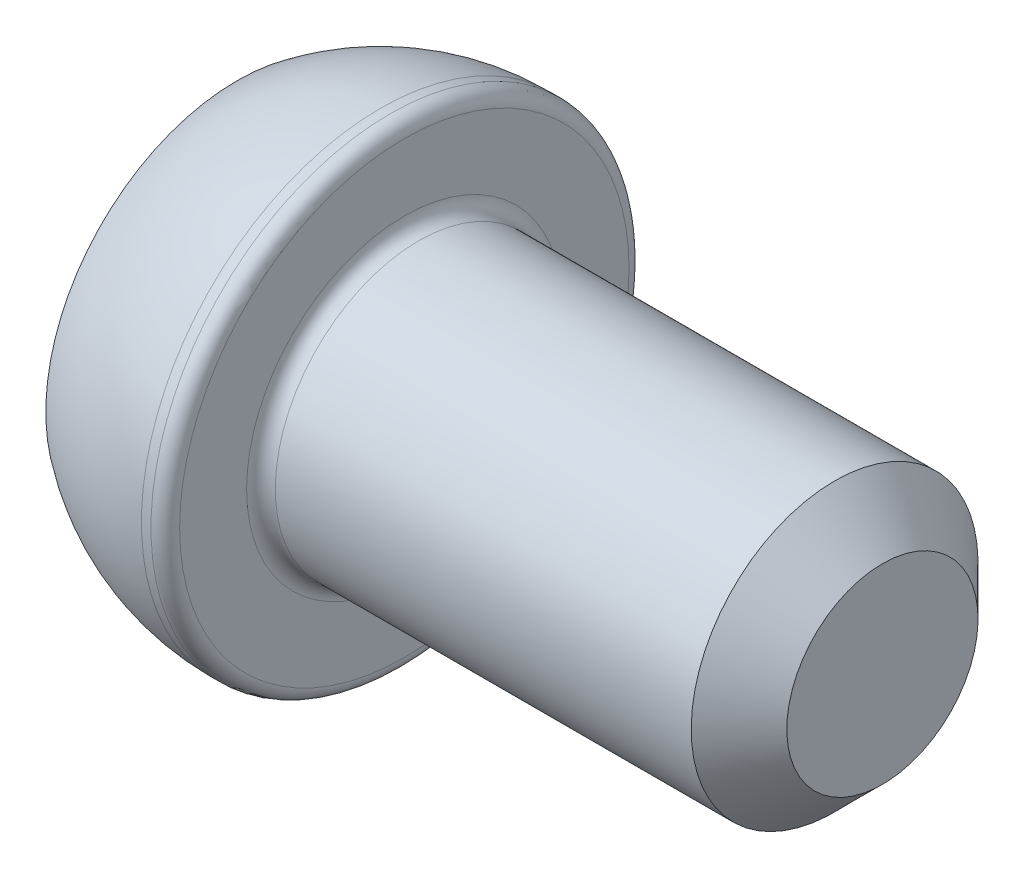
ISO-10303-21;
HEADER;
FILE_DESCRIPTION(('STEP AP214'),'2;1');
FILE_NAME('part.step','',(''),(''),'','','');
FILE_SCHEMA(('AUTOMOTIVE_DESIGN { 1 0 10303 214 1 1 1 1 }'));
ENDSEC;
DATA;
#1=APPLICATION_CONTEXT('core data for automotive mechanical design processes');
#2=APPLICATION_PROTOCOL_DEFINITION('international standard','automotive_design',2000,#1);
#3=PRODUCT_CONTEXT('',#1,'mechanical');
#4=PRODUCT('Part','Part','',(#3));
#5=PRODUCT_RELATED_PRODUCT_CATEGORY('part','',(#4));
#6=PRODUCT_DEFINITION_FORMATION('','',#4);
#7=PRODUCT_DEFINITION_CONTEXT('part definition',#1,'design');
#8=PRODUCT_DEFINITION('design','',#6,#7);
#9=PRODUCT_DEFINITION_SHAPE('','',#8);
#10=(LENGTH_UNIT() NAMED_UNIT(*) SI_UNIT(.MILLI.,.METRE.));
#11=(NAMED_UNIT(*) PLANE_ANGLE_UNIT() SI_UNIT($,.RADIAN.));
#12=(NAMED_UNIT(*) SI_UNIT($,.STERADIAN.) SOLID_ANGLE_UNIT());
#13=UNCERTAINTY_MEASURE_WITH_UNIT(LENGTH_MEASURE(1.E-05),#10,'distance_accuracy_value','');
#14=(GEOMETRIC_REPRESENTATION_CONTEXT(3) GLOBAL_UNCERTAINTY_ASSIGNED_CONTEXT((#13)) GLOBAL_UNIT_ASSIGNED_CONTEXT((#10,
#11,#12)) REPRESENTATION_CONTEXT('',''));
#15=CARTESIAN_POINT('',(0.,0.,0.));
#16=DIRECTION('',(0.,0.,1.));
#17=DIRECTION('',(1.,0.,0.));
#18=AXIS2_PLACEMENT_3D('',#15,#16,#17);
#19=CARTESIAN_POINT('',(0.,0.,0.));
#20=DIRECTION('',(-1.,0.,0.));
#21=DIRECTION('',(0.,-1.,0.));
#22=AXIS2_PLACEMENT_3D('',#19,#20,#21);
#23=PLANE('',#22);
#24=DIRECTION('',(0.,0.866025403784438,-0.5));
#25=VECTOR('',#24,1.);
#26=CARTESIAN_POINT('',(0.,0.,2.3094010767585));
#27=LINE('',#26,#25);
#28=CARTESIAN_POINT('',(0.,0.,2.3094010767585));
#29=VERTEX_POINT('',#28);
#30=CARTESIAN_POINT('',(0.,2.,1.15470053837925));
#31=VERTEX_POINT('',#30);
#32=EDGE_CURVE('E54',#29,#31,#27,.T.);
#33=ORIENTED_EDGE('',*,*,#32,.F.);
#34=DIRECTION('',(0.,0.866025403784439,0.5));
#35=VECTOR('',#34,1.);
#36=CARTESIAN_POINT('',(0.,-2.,1.15470053837925));
#37=LINE('',#36,#35);
#38=CARTESIAN_POINT('',(0.,-2.,1.15470053837925));
#39=VERTEX_POINT('',#38);
#40=EDGE_CURVE('E137',#39,#29,#37,.T.);
#41=ORIENTED_EDGE('',*,*,#40,.F.);
#42=DIRECTION('',(0.,0.,1.));
#43=VECTOR('',#42,1.);
#44=CARTESIAN_POINT('',(0.,-2.,-1.15470053837925));
#45=LINE('',#44,#43);
#46=CARTESIAN_POINT('',(0.,-2.,-1.15470053837925));
#47=VERTEX_POINT('',#46);
#48=EDGE_CURVE('E135',#47,#39,#45,.T.);
#49=ORIENTED_EDGE('',*,*,#48,.F.);
#50=DIRECTION('',(0.,-0.866025403784439,0.5));
#51=VECTOR('',#50,1.);
#52=CARTESIAN_POINT('',(0.,0.,-2.3094010767585));
#53=LINE('',#52,#51);
#54=CARTESIAN_POINT('',(0.,0.,-2.3094010767585));
#55=VERTEX_POINT('',#54);
#56=EDGE_CURVE('E102',#55,#47,#53,.T.);
#57=ORIENTED_EDGE('',*,*,#56,.F.);
#58=DIRECTION('',(0.,-0.866025403784439,-0.5));
#59=VECTOR('',#58,1.);
#60=CARTESIAN_POINT('',(0.,2.,-1.15470053837925));
#61=LINE('',#60,#59);
#62=CARTESIAN_POINT('',(0.,2.,-1.15470053837925));
#63=VERTEX_POINT('',#62);
#64=EDGE_CURVE('E131',#63,#55,#61,.T.);
#65=ORIENTED_EDGE('',*,*,#64,.F.);
#66=DIRECTION('',(0.,0.,-1.));
#67=VECTOR('',#66,1.);
#68=CARTESIAN_POINT('',(0.,2.,1.15470053837925));
#69=LINE('',#68,#67);
#70=EDGE_CURVE('E128',#31,#63,#69,.T.);
#71=ORIENTED_EDGE('',*,*,#70,.F.);
#72=EDGE_LOOP('',(#33,#41,#49,#57,#65,#71));
#73=FACE_BOUND('',#72,.T.);
#74=CARTESIAN_POINT('',(0.,0.,0.));
#75=DIRECTION('',(1.,0.,0.));
#76=DIRECTION('',(0.,1.,0.));
#77=AXIS2_PLACEMENT_3D('',#74,#75,#76);
#78=CIRCLE('',#77,4.);
#79=CARTESIAN_POINT('',(0.,4.,0.));
#80=VERTEX_POINT('',#79);
#81=EDGE_CURVE('E149',#80,#80,#78,.T.);
#82=ORIENTED_EDGE('',*,*,#81,.F.);
#83=EDGE_LOOP('',(#82));
#84=FACE_BOUND('',#83,.T.);
#85=ADVANCED_FACE('F38',(#73,#84),#23,.T.);
#86=CARTESIAN_POINT('',(3.,0.,0.));
#87=DIRECTION('',(1.,0.,0.));
#88=DIRECTION('',(0.,1.,0.));
#89=AXIS2_PLACEMENT_3D('',#86,#87,#88);
#90=SPHERICAL_SURFACE('',#89,5.);
#91=ORIENTED_EDGE('',*,*,#81,.T.);
#92=EDGE_LOOP('',(#91));
#93=FACE_BOUND('',#92,.T.);
#94=CARTESIAN_POINT('',(3.,0.,0.));
#95=DIRECTION('',(1.,0.,0.));
#96=DIRECTION('',(0.,1.,0.));
#97=AXIS2_PLACEMENT_3D('',#94,#95,#96);
#98=CIRCLE('',#97,5.);
#99=CARTESIAN_POINT('',(3.,5.,0.));
#100=VERTEX_POINT('',#99);
#101=EDGE_CURVE('E141',#100,#100,#98,.T.);
#102=ORIENTED_EDGE('',*,*,#101,.F.);
#103=EDGE_LOOP('',(#102));
#104=FACE_BOUND('',#103,.T.);
#105=ADVANCED_FACE('F178',(#93,#104),#90,.T.);
#106=CARTESIAN_POINT('',(13.5,0.,0.));
#107=DIRECTION('',(1.,0.,0.));
#108=DIRECTION('',(0.,1.,0.));
#109=AXIS2_PLACEMENT_3D('',#106,#107,#108);
#110=CYLINDRICAL_SURFACE('',#109,5.);
#111=CARTESIAN_POINT('',(3.2,0.,0.));
#112=DIRECTION('',(1.,0.,0.));
#113=DIRECTION('',(0.,1.,0.));
#114=AXIS2_PLACEMENT_3D('',#111,#112,#113);
#115=CIRCLE('',#114,5.);
#116=CARTESIAN_POINT('',(3.2,5.,0.));
#117=VERTEX_POINT('',#116);
#118=EDGE_CURVE('E161',#117,#117,#115,.F.);
#119=ORIENTED_EDGE('',*,*,#118,.T.);
#120=EDGE_LOOP('',(#119));
#121=FACE_BOUND('',#120,.T.);
#122=ORIENTED_EDGE('',*,*,#101,.T.);
#123=EDGE_LOOP('',(#122));
#124=FACE_BOUND('',#123,.T.);
#125=ADVANCED_FACE('F184',(#121,#124),#110,.T.);
#126=CARTESIAN_POINT('',(3.5,5.,0.));
#127=DIRECTION('',(1.,0.,0.));
#128=DIRECTION('',(0.,1.,0.));
#129=AXIS2_PLACEMENT_3D('',#126,#127,#128);
#130=PLANE('',#129);
#131=CARTESIAN_POINT('',(3.5,0.,0.));
#132=DIRECTION('',(1.,0.,0.));
#133=DIRECTION('',(0.,1.,0.));
#134=AXIS2_PLACEMENT_3D('',#131,#132,#133);
#135=CIRCLE('',#134,3.3);
#136=CARTESIAN_POINT('',(3.5,3.3,0.));
#137=VERTEX_POINT('',#136);
#138=EDGE_CURVE('E158',#137,#137,#135,.F.);
#139=ORIENTED_EDGE('',*,*,#138,.T.);
#140=EDGE_LOOP('',(#139));
#141=FACE_BOUND('',#140,.T.);
#142=CARTESIAN_POINT('',(3.5,0.,0.));
#143=DIRECTION('',(1.,0.,0.));
#144=DIRECTION('',(0.,1.,0.));
#145=AXIS2_PLACEMENT_3D('',#142,#143,#144);
#146=CIRCLE('',#145,4.7);
#147=CARTESIAN_POINT('',(3.5,4.7,0.));
#148=VERTEX_POINT('',#147);
#149=EDGE_CURVE('E155',#148,#148,#146,.T.);
#150=ORIENTED_EDGE('',*,*,#149,.T.);
#151=EDGE_LOOP('',(#150));
#152=FACE_BOUND('',#151,.T.);
#153=ADVANCED_FACE('F203',(#141,#152),#130,.T.);
#154=CARTESIAN_POINT('',(13.5,0.,0.));
#155=DIRECTION('',(1.,0.,0.));
#156=DIRECTION('',(0.,1.,0.));
#157=AXIS2_PLACEMENT_3D('',#154,#155,#156);
#158=CYLINDRICAL_SURFACE('',#157,3.);
#159=CARTESIAN_POINT('',(12.5,0.,0.));
#160=DIRECTION('',(1.,0.,0.));
#161=DIRECTION('',(0.,1.,0.));
#162=AXIS2_PLACEMENT_3D('',#159,#160,#161);
#163=CIRCLE('',#162,3.);
#164=CARTESIAN_POINT('',(12.5,3.,0.));
#165=VERTEX_POINT('',#164);
#166=EDGE_CURVE('E11',#165,#165,#163,.F.);
#167=ORIENTED_EDGE('',*,*,#166,.T.);
#168=EDGE_LOOP('',(#167));
#169=FACE_BOUND('',#168,.T.);
#170=CARTESIAN_POINT('',(3.8,0.,0.));
#171=DIRECTION('',(1.,0.,0.));
#172=DIRECTION('',(0.,1.,0.));
#173=AXIS2_PLACEMENT_3D('',#170,#171,#172);
#174=CIRCLE('',#173,3.);
#175=CARTESIAN_POINT('',(3.8,3.,0.));
#176=VERTEX_POINT('',#175);
#177=EDGE_CURVE('E152',#176,#176,#174,.T.);
#178=ORIENTED_EDGE('',*,*,#177,.T.);
#179=EDGE_LOOP('',(#178));
#180=FACE_BOUND('',#179,.T.);
#181=ADVANCED_FACE('F201',(#169,#180),#158,.T.);
#182=CARTESIAN_POINT('',(13.5,3.,0.));
#183=DIRECTION('',(1.,0.,0.));
#184=DIRECTION('',(0.,1.,0.));
#185=AXIS2_PLACEMENT_3D('',#182,#183,#184);
#186=PLANE('',#185);
#187=CARTESIAN_POINT('',(13.5,0.,0.));
#188=DIRECTION('',(1.,0.,0.));
#189=DIRECTION('',(0.,1.,0.));
#190=AXIS2_PLACEMENT_3D('',#187,#188,#189);
#191=CIRCLE('',#190,2.);
#192=CARTESIAN_POINT('',(13.5,2.,0.));
#193=VERTEX_POINT('',#192);
#194=EDGE_CURVE('E47',#193,#193,#191,.T.);
#195=ORIENTED_EDGE('',*,*,#194,.T.);
#196=EDGE_LOOP('',(#195));
#197=FACE_BOUND('',#196,.T.);
#198=ADVANCED_FACE('F166',(#197),#186,.T.);
#199=CARTESIAN_POINT('',(2.,0.,2.3094010767585));
#200=DIRECTION('',(0.,0.5,0.866025403784439));
#201=DIRECTION('',(0.,-0.866025403784438,0.5));
#202=AXIS2_PLACEMENT_3D('',#199,#200,#201);
#203=PLANE('',#202);
#204=ORIENTED_EDGE('',*,*,#32,.T.);
#205=DIRECTION('',(-1.,0.,0.));
#206=VECTOR('',#205,1.);
#207=CARTESIAN_POINT('',(2.,2.,1.15470053837925));
#208=LINE('',#207,#206);
#209=CARTESIAN_POINT('',(2.,2.,1.15470053837925));
#210=VERTEX_POINT('',#209);
#211=EDGE_CURVE('E84',#210,#31,#208,.T.);
#212=ORIENTED_EDGE('',*,*,#211,.F.);
#213=DIRECTION('',(0.,0.866025403784438,-0.5));
#214=VECTOR('',#213,1.);
#215=CARTESIAN_POINT('',(2.,0.,2.3094010767585));
#216=LINE('',#215,#214);
#217=CARTESIAN_POINT('',(2.,0.,2.3094010767585));
#218=VERTEX_POINT('',#217);
#219=EDGE_CURVE('E139',#218,#210,#216,.T.);
#220=ORIENTED_EDGE('',*,*,#219,.F.);
#221=DIRECTION('',(-1.,0.,0.));
#222=VECTOR('',#221,1.);
#223=CARTESIAN_POINT('',(2.,0.,2.3094010767585));
#224=LINE('',#223,#222);
#225=EDGE_CURVE('E62',#218,#29,#224,.T.);
#226=ORIENTED_EDGE('',*,*,#225,.T.);
#227=EDGE_LOOP('',(#204,#212,#220,#226));
#228=FACE_BOUND('',#227,.T.);
#229=ADVANCED_FACE('F210',(#228),#203,.F.);
#230=CARTESIAN_POINT('',(2.,-2.,1.15470053837925));
#231=DIRECTION('',(0.,-0.5,0.866025403784439));
#232=DIRECTION('',(0.,-0.866025403784439,-0.5));
#233=AXIS2_PLACEMENT_3D('',#230,#231,#232);
#234=PLANE('',#233);
#235=ORIENTED_EDGE('',*,*,#40,.T.);
#236=ORIENTED_EDGE('',*,*,#225,.F.);
#237=DIRECTION('',(0.,0.866025403784439,0.5));
#238=VECTOR('',#237,1.);
#239=CARTESIAN_POINT('',(2.,-2.,1.15470053837925));
#240=LINE('',#239,#238);
#241=CARTESIAN_POINT('',(2.,-2.,1.15470053837925));
#242=VERTEX_POINT('',#241);
#243=EDGE_CURVE('E114',#242,#218,#240,.T.);
#244=ORIENTED_EDGE('',*,*,#243,.F.);
#245=DIRECTION('',(-1.,0.,0.));
#246=VECTOR('',#245,1.);
#247=CARTESIAN_POINT('',(2.,-2.,1.15470053837925));
#248=LINE('',#247,#246);
#249=EDGE_CURVE('E106',#242,#39,#248,.T.);
#250=ORIENTED_EDGE('',*,*,#249,.T.);
#251=EDGE_LOOP('',(#235,#236,#244,#250));
#252=FACE_BOUND('',#251,.T.);
#253=ADVANCED_FACE('F269',(#252),#234,.F.);
#254=CARTESIAN_POINT('',(2.,-2.,-1.15470053837925));
#255=DIRECTION('',(0.,-1.,0.));
#256=DIRECTION('',(0.,0.,-1.));
#257=AXIS2_PLACEMENT_3D('',#254,#255,#256);
#258=PLANE('',#257);
#259=ORIENTED_EDGE('',*,*,#48,.T.);
#260=ORIENTED_EDGE('',*,*,#249,.F.);
#261=DIRECTION('',(0.,0.,1.));
#262=VECTOR('',#261,1.);
#263=CARTESIAN_POINT('',(2.,-2.,-1.15470053837925));
#264=LINE('',#263,#262);
#265=CARTESIAN_POINT('',(2.,-2.,-1.15470053837925));
#266=VERTEX_POINT('',#265);
#267=EDGE_CURVE('E110',#266,#242,#264,.T.);
#268=ORIENTED_EDGE('',*,*,#267,.F.);
#269=DIRECTION('',(-1.,0.,0.));
#270=VECTOR('',#269,1.);
#271=CARTESIAN_POINT('',(2.,-2.,-1.15470053837925));
#272=LINE('',#271,#270);
#273=EDGE_CURVE('E95',#266,#47,#272,.T.);
#274=ORIENTED_EDGE('',*,*,#273,.T.);
#275=EDGE_LOOP('',(#259,#260,#268,#274));
#276=FACE_BOUND('',#275,.T.);
#277=ADVANCED_FACE('F111',(#276),#258,.F.);
#278=CARTESIAN_POINT('',(2.,0.,-2.3094010767585));
#279=DIRECTION('',(0.,-0.5,-0.866025403784439));
#280=DIRECTION('',(0.,0.866025403784439,-0.5));
#281=AXIS2_PLACEMENT_3D('',#278,#279,#280);
#282=PLANE('',#281);
#283=ORIENTED_EDGE('',*,*,#56,.T.);
#284=ORIENTED_EDGE('',*,*,#273,.F.);
#285=DIRECTION('',(0.,-0.866025403784439,0.5));
#286=VECTOR('',#285,1.);
#287=CARTESIAN_POINT('',(2.,0.,-2.3094010767585));
#288=LINE('',#287,#286);
#289=CARTESIAN_POINT('',(2.,0.,-2.3094010767585));
#290=VERTEX_POINT('',#289);
#291=EDGE_CURVE('E99',#290,#266,#288,.T.);
#292=ORIENTED_EDGE('',*,*,#291,.F.);
#293=DIRECTION('',(-1.,0.,0.));
#294=VECTOR('',#293,1.);
#295=CARTESIAN_POINT('',(2.,0.,-2.3094010767585));
#296=LINE('',#295,#294);
#297=EDGE_CURVE('E107',#290,#55,#296,.T.);
#298=ORIENTED_EDGE('',*,*,#297,.T.);
#299=EDGE_LOOP('',(#283,#284,#292,#298));
#300=FACE_BOUND('',#299,.T.);
#301=ADVANCED_FACE('F97',(#300),#282,.F.);
#302=CARTESIAN_POINT('',(2.,2.,-1.15470053837925));
#303=DIRECTION('',(0.,0.5,-0.866025403784439));
#304=DIRECTION('',(0.,0.866025403784439,0.5));
#305=AXIS2_PLACEMENT_3D('',#302,#303,#304);
#306=PLANE('',#305);
#307=ORIENTED_EDGE('',*,*,#64,.T.);
#308=ORIENTED_EDGE('',*,*,#297,.F.);
#309=DIRECTION('',(0.,-0.866025403784439,-0.5));
#310=VECTOR('',#309,1.);
#311=CARTESIAN_POINT('',(2.,2.,-1.15470053837925));
#312=LINE('',#311,#310);
#313=CARTESIAN_POINT('',(2.,2.,-1.15470053837925));
#314=VERTEX_POINT('',#313);
#315=EDGE_CURVE('E120',#314,#290,#312,.T.);
#316=ORIENTED_EDGE('',*,*,#315,.F.);
#317=DIRECTION('',(-1.,0.,0.));
#318=VECTOR('',#317,1.);
#319=CARTESIAN_POINT('',(2.,2.,-1.15470053837925));
#320=LINE('',#319,#318);
#321=EDGE_CURVE('E144',#314,#63,#320,.T.);
#322=ORIENTED_EDGE('',*,*,#321,.T.);
#323=EDGE_LOOP('',(#307,#308,#316,#322));
#324=FACE_BOUND('',#323,.T.);
#325=ADVANCED_FACE('F286',(#324),#306,.F.);
#326=CARTESIAN_POINT('',(2.,2.,1.15470053837925));
#327=DIRECTION('',(0.,1.,0.));
#328=DIRECTION('',(0.,0.,1.));
#329=AXIS2_PLACEMENT_3D('',#326,#327,#328);
#330=PLANE('',#329);
#331=ORIENTED_EDGE('',*,*,#70,.T.);
#332=ORIENTED_EDGE('',*,*,#321,.F.);
#333=DIRECTION('',(0.,0.,-1.));
#334=VECTOR('',#333,1.);
#335=CARTESIAN_POINT('',(2.,2.,1.15470053837925));
#336=LINE('',#335,#334);
#337=EDGE_CURVE('E122',#210,#314,#336,.T.);
#338=ORIENTED_EDGE('',*,*,#337,.F.);
#339=ORIENTED_EDGE('',*,*,#211,.T.);
#340=EDGE_LOOP('',(#331,#332,#338,#339));
#341=FACE_BOUND('',#340,.T.);
#342=ADVANCED_FACE('F195',(#341),#330,.F.);
#343=CARTESIAN_POINT('',(2.,0.,0.));
#344=DIRECTION('',(-1.,0.,0.));
#345=DIRECTION('',(0.,0.,1.));
#346=AXIS2_PLACEMENT_3D('',#343,#344,#345);
#347=PLANE('',#346);
#348=ORIENTED_EDGE('',*,*,#219,.T.);
#349=ORIENTED_EDGE('',*,*,#337,.T.);
#350=ORIENTED_EDGE('',*,*,#315,.T.);
#351=ORIENTED_EDGE('',*,*,#291,.T.);
#352=ORIENTED_EDGE('',*,*,#267,.T.);
#353=ORIENTED_EDGE('',*,*,#243,.T.);
#354=EDGE_LOOP('',(#348,#349,#350,#351,#352,#353));
#355=FACE_BOUND('',#354,.T.);
#356=ADVANCED_FACE('F117',(#355),#347,.T.);
#357=CARTESIAN_POINT('',(3.8,0.,0.));
#358=DIRECTION('',(1.,0.,0.));
#359=DIRECTION('',(0.,1.,0.));
#360=AXIS2_PLACEMENT_3D('',#357,#358,#359);
#361=TOROIDAL_SURFACE('',#360,3.3,0.3);
#362=ORIENTED_EDGE('',*,*,#138,.F.);
#363=EDGE_LOOP('',(#362));
#364=FACE_BOUND('',#363,.T.);
#365=ORIENTED_EDGE('',*,*,#177,.F.);
#366=EDGE_LOOP('',(#365));
#367=FACE_BOUND('',#366,.T.);
#368=ADVANCED_FACE('F174',(#364,#367),#361,.F.);
#369=CARTESIAN_POINT('',(3.2,0.,0.));
#370=DIRECTION('',(1.,0.,0.));
#371=DIRECTION('',(0.,1.,0.));
#372=AXIS2_PLACEMENT_3D('',#369,#370,#371);
#373=TOROIDAL_SURFACE('',#372,4.7,0.3);
#374=ORIENTED_EDGE('',*,*,#118,.F.);
#375=EDGE_LOOP('',(#374));
#376=FACE_BOUND('',#375,.T.);
#377=ORIENTED_EDGE('',*,*,#149,.F.);
#378=EDGE_LOOP('',(#377));
#379=FACE_BOUND('',#378,.T.);
#380=ADVANCED_FACE('F169',(#376,#379),#373,.T.);
#381=CARTESIAN_POINT('',(13.5,0.,0.));
#382=DIRECTION('',(-1.,0.,0.));
#383=DIRECTION('',(0.,-1.,0.));
#384=AXIS2_PLACEMENT_3D('',#381,#382,#383);
#385=CONICAL_SURFACE('',#384,2.,0.785398163397446);
#386=ORIENTED_EDGE('',*,*,#166,.F.);
#387=EDGE_LOOP('',(#386));
#388=FACE_BOUND('',#387,.T.);
#389=ORIENTED_EDGE('',*,*,#194,.F.);
#390=EDGE_LOOP('',(#389));
#391=FACE_BOUND('',#390,.T.);
#392=ADVANCED_FACE('F41',(#388,#391),#385,.T.);
#393=CLOSED_SHELL('',(#85,#105,#125,#153,#181,#198,#229,#253,#277,#301,#325,#342,#356,#368,#380,#392));
#394=MANIFOLD_SOLID_BREP('B2',#393);
#395=ADVANCED_BREP_SHAPE_REPRESENTATION('',(#18,#394),#14);
#396=SHAPE_DEFINITION_REPRESENTATION(#9,#395);
ENDSEC;
END-ISO-10303-21;
